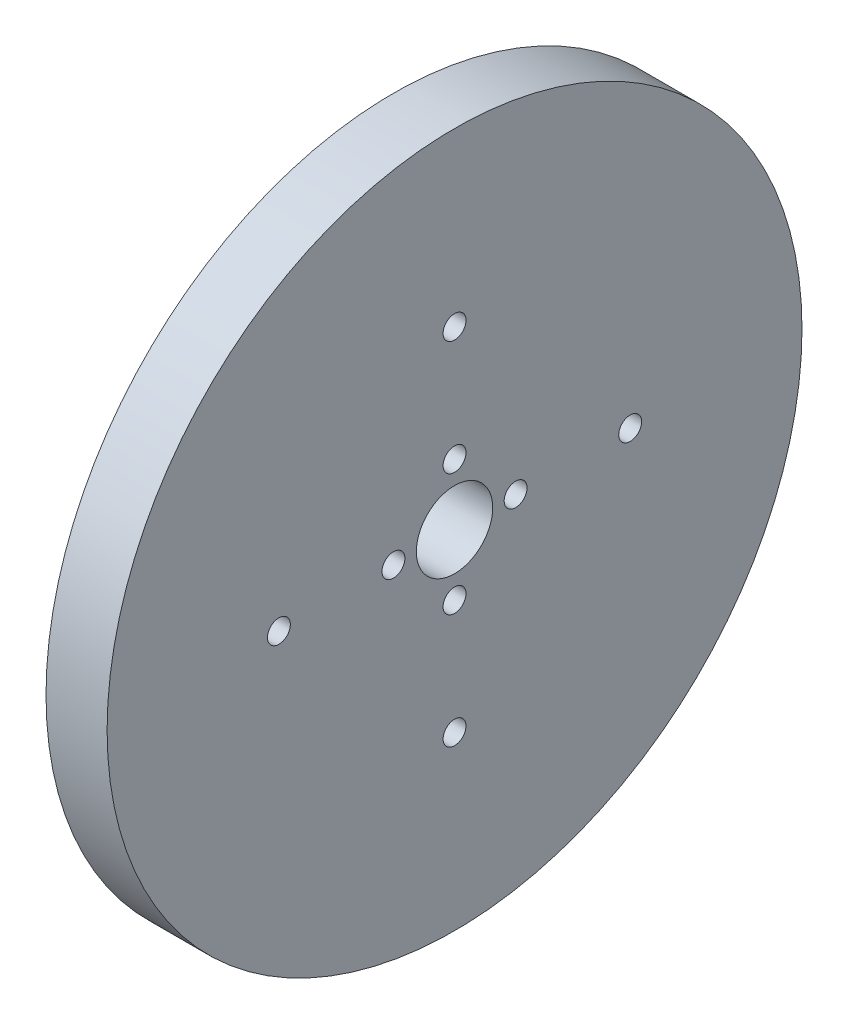
ISO-10303-21;
HEADER;
FILE_DESCRIPTION(('STEP AP214'),'2;1');
FILE_NAME('part.step','',(''),(''),'','','');
FILE_SCHEMA(('AUTOMOTIVE_DESIGN { 1 0 10303 214 1 1 1 1 }'));
ENDSEC;
DATA;
#1=APPLICATION_CONTEXT('core data for automotive mechanical design processes');
#2=APPLICATION_PROTOCOL_DEFINITION('international standard','automotive_design',2000,#1);
#3=PRODUCT_CONTEXT('',#1,'mechanical');
#4=PRODUCT('Part','Part','',(#3));
#5=PRODUCT_RELATED_PRODUCT_CATEGORY('part','',(#4));
#6=PRODUCT_DEFINITION_FORMATION('','',#4);
#7=PRODUCT_DEFINITION_CONTEXT('part definition',#1,'design');
#8=PRODUCT_DEFINITION('design','',#6,#7);
#9=PRODUCT_DEFINITION_SHAPE('','',#8);
#10=(LENGTH_UNIT() NAMED_UNIT(*) SI_UNIT(.MILLI.,.METRE.));
#11=(NAMED_UNIT(*) PLANE_ANGLE_UNIT() SI_UNIT($,.RADIAN.));
#12=(NAMED_UNIT(*) SI_UNIT($,.STERADIAN.) SOLID_ANGLE_UNIT());
#13=UNCERTAINTY_MEASURE_WITH_UNIT(LENGTH_MEASURE(1.E-05),#10,'distance_accuracy_value','');
#14=(GEOMETRIC_REPRESENTATION_CONTEXT(3) GLOBAL_UNCERTAINTY_ASSIGNED_CONTEXT((#13)) GLOBAL_UNIT_ASSIGNED_CONTEXT((#10,
#11,#12)) REPRESENTATION_CONTEXT('',''));
#15=CARTESIAN_POINT('',(0.,0.,0.));
#16=DIRECTION('',(0.,0.,1.));
#17=DIRECTION('',(1.,0.,0.));
#18=AXIS2_PLACEMENT_3D('',#15,#16,#17);
#19=CARTESIAN_POINT('',(8.,0.,0.));
#20=DIRECTION('',(-1.,0.,0.));
#21=DIRECTION('',(0.,0.,-1.));
#22=AXIS2_PLACEMENT_3D('',#19,#20,#21);
#23=CYLINDRICAL_SURFACE('',#22,45.5);
#24=CARTESIAN_POINT('',(8.,0.,0.));
#25=DIRECTION('',(-1.,0.,0.));
#26=DIRECTION('',(0.,0.,1.));
#27=AXIS2_PLACEMENT_3D('',#24,#25,#26);
#28=CIRCLE('',#27,45.5);
#29=CARTESIAN_POINT('',(8.,0.,45.5));
#30=VERTEX_POINT('',#29);
#31=EDGE_CURVE('E10',#30,#30,#28,.T.);
#32=ORIENTED_EDGE('',*,*,#31,.T.);
#33=EDGE_LOOP('',(#32));
#34=FACE_BOUND('',#33,.T.);
#35=CARTESIAN_POINT('',(0.,0.,0.));
#36=DIRECTION('',(-1.,0.,0.));
#37=DIRECTION('',(0.,0.,1.));
#38=AXIS2_PLACEMENT_3D('',#35,#36,#37);
#39=CIRCLE('',#38,45.5);
#40=CARTESIAN_POINT('',(0.,0.,45.5));
#41=VERTEX_POINT('',#40);
#42=EDGE_CURVE('E38',#41,#41,#39,.T.);
#43=ORIENTED_EDGE('',*,*,#42,.F.);
#44=EDGE_LOOP('',(#43));
#45=FACE_BOUND('',#44,.T.);
#46=ADVANCED_FACE('F35',(#34,#45),#23,.T.);
#47=CARTESIAN_POINT('',(8.,0.,0.));
#48=DIRECTION('',(1.,0.,0.));
#49=DIRECTION('',(0.,0.,1.));
#50=AXIS2_PLACEMENT_3D('',#47,#48,#49);
#51=PLANE('',#50);
#52=CARTESIAN_POINT('',(8.,-6.53699316899292E-13,-22.9999999999993));
#53=DIRECTION('',(-1.,0.,0.));
#54=DIRECTION('',(0.,0.,1.));
#55=AXIS2_PLACEMENT_3D('',#52,#53,#54);
#56=CIRCLE('',#55,1.50000000000105);
#57=CARTESIAN_POINT('',(8.,-6.53699316899292E-13,-21.4999999999983));
#58=VERTEX_POINT('',#57);
#59=EDGE_CURVE('E92',#58,#58,#56,.T.);
#60=ORIENTED_EDGE('',*,*,#59,.T.);
#61=EDGE_LOOP('',(#60));
#62=FACE_BOUND('',#61,.T.);
#63=CARTESIAN_POINT('',(8.,0.,-8.));
#64=DIRECTION('',(-1.,0.,0.));
#65=DIRECTION('',(0.,0.,1.));
#66=AXIS2_PLACEMENT_3D('',#63,#64,#65);
#67=CIRCLE('',#66,1.5);
#68=CARTESIAN_POINT('',(8.,0.,-6.5));
#69=VERTEX_POINT('',#68);
#70=EDGE_CURVE('E86',#69,#69,#67,.T.);
#71=ORIENTED_EDGE('',*,*,#70,.T.);
#72=EDGE_LOOP('',(#71));
#73=FACE_BOUND('',#72,.T.);
#74=CARTESIAN_POINT('',(8.,-23.0000000000001,0.));
#75=DIRECTION('',(-1.,0.,0.));
#76=DIRECTION('',(0.,0.,1.));
#77=AXIS2_PLACEMENT_3D('',#74,#75,#76);
#78=CIRCLE('',#77,1.50000000000005);
#79=CARTESIAN_POINT('',(8.,-23.0000000000001,1.49999999999996));
#80=VERTEX_POINT('',#79);
#81=EDGE_CURVE('E80',#80,#80,#78,.T.);
#82=ORIENTED_EDGE('',*,*,#81,.T.);
#83=EDGE_LOOP('',(#82));
#84=FACE_BOUND('',#83,.T.);
#85=CARTESIAN_POINT('',(8.,-8.,0.));
#86=DIRECTION('',(-1.,0.,0.));
#87=DIRECTION('',(0.,0.,1.));
#88=AXIS2_PLACEMENT_3D('',#85,#86,#87);
#89=CIRCLE('',#88,1.5);
#90=CARTESIAN_POINT('',(8.,-8.,1.49999999999994));
#91=VERTEX_POINT('',#90);
#92=EDGE_CURVE('E74',#91,#91,#89,.T.);
#93=ORIENTED_EDGE('',*,*,#92,.T.);
#94=EDGE_LOOP('',(#93));
#95=FACE_BOUND('',#94,.T.);
#96=CARTESIAN_POINT('',(8.,0.,23.));
#97=DIRECTION('',(-1.,0.,0.));
#98=DIRECTION('',(0.,0.,1.));
#99=AXIS2_PLACEMENT_3D('',#96,#97,#98);
#100=CIRCLE('',#99,1.5);
#101=CARTESIAN_POINT('',(8.,0.,24.5));
#102=VERTEX_POINT('',#101);
#103=EDGE_CURVE('E68',#102,#102,#100,.T.);
#104=ORIENTED_EDGE('',*,*,#103,.T.);
#105=EDGE_LOOP('',(#104));
#106=FACE_BOUND('',#105,.T.);
#107=CARTESIAN_POINT('',(8.,0.,8.));
#108=DIRECTION('',(-1.,0.,0.));
#109=DIRECTION('',(0.,0.,1.));
#110=AXIS2_PLACEMENT_3D('',#107,#108,#109);
#111=CIRCLE('',#110,1.5);
#112=CARTESIAN_POINT('',(8.,0.,9.5));
#113=VERTEX_POINT('',#112);
#114=EDGE_CURVE('E62',#113,#113,#111,.T.);
#115=ORIENTED_EDGE('',*,*,#114,.T.);
#116=EDGE_LOOP('',(#115));
#117=FACE_BOUND('',#116,.T.);
#118=CARTESIAN_POINT('',(8.,8.,0.));
#119=DIRECTION('',(-1.,0.,0.));
#120=DIRECTION('',(0.,0.,1.));
#121=AXIS2_PLACEMENT_3D('',#118,#119,#120);
#122=CIRCLE('',#121,1.5);
#123=CARTESIAN_POINT('',(8.,8.,1.5));
#124=VERTEX_POINT('',#123);
#125=EDGE_CURVE('E56',#124,#124,#122,.T.);
#126=ORIENTED_EDGE('',*,*,#125,.T.);
#127=EDGE_LOOP('',(#126));
#128=FACE_BOUND('',#127,.T.);
#129=CARTESIAN_POINT('',(8.,23.,0.));
#130=DIRECTION('',(-1.,0.,0.));
#131=DIRECTION('',(0.,0.,1.));
#132=AXIS2_PLACEMENT_3D('',#129,#130,#131);
#133=CIRCLE('',#132,1.5);
#134=CARTESIAN_POINT('',(8.,23.,1.5));
#135=VERTEX_POINT('',#134);
#136=EDGE_CURVE('E50',#135,#135,#133,.T.);
#137=ORIENTED_EDGE('',*,*,#136,.T.);
#138=EDGE_LOOP('',(#137));
#139=FACE_BOUND('',#138,.T.);
#140=CARTESIAN_POINT('',(8.,0.,0.));
#141=DIRECTION('',(-1.,0.,0.));
#142=DIRECTION('',(0.,0.,1.));
#143=AXIS2_PLACEMENT_3D('',#140,#141,#142);
#144=CIRCLE('',#143,5.);
#145=CARTESIAN_POINT('',(8.,0.,5.));
#146=VERTEX_POINT('',#145);
#147=EDGE_CURVE('E45',#146,#146,#144,.T.);
#148=ORIENTED_EDGE('',*,*,#147,.T.);
#149=EDGE_LOOP('',(#148));
#150=FACE_BOUND('',#149,.T.);
#151=ORIENTED_EDGE('',*,*,#31,.F.);
#152=EDGE_LOOP('',(#151));
#153=FACE_BOUND('',#152,.T.);
#154=ADVANCED_FACE('F101',(#62,#73,#84,#95,#106,#117,#128,#139,#150,#153),#51,.T.);
#155=CARTESIAN_POINT('',(0.,0.,0.));
#156=DIRECTION('',(1.,0.,0.));
#157=DIRECTION('',(0.,0.,1.));
#158=AXIS2_PLACEMENT_3D('',#155,#156,#157);
#159=PLANE('',#158);
#160=CARTESIAN_POINT('',(0.,-6.53699316899292E-13,-22.9999999999993));
#161=DIRECTION('',(-1.,0.,0.));
#162=DIRECTION('',(0.,0.,1.));
#163=AXIS2_PLACEMENT_3D('',#160,#161,#162);
#164=CIRCLE('',#163,1.50000000000105);
#165=CARTESIAN_POINT('',(0.,-6.53699316899292E-13,-21.4999999999983));
#166=VERTEX_POINT('',#165);
#167=EDGE_CURVE('E95',#166,#166,#164,.T.);
#168=ORIENTED_EDGE('',*,*,#167,.F.);
#169=EDGE_LOOP('',(#168));
#170=FACE_BOUND('',#169,.T.);
#171=CARTESIAN_POINT('',(0.,0.,-8.));
#172=DIRECTION('',(-1.,0.,0.));
#173=DIRECTION('',(0.,0.,1.));
#174=AXIS2_PLACEMENT_3D('',#171,#172,#173);
#175=CIRCLE('',#174,1.5);
#176=CARTESIAN_POINT('',(0.,0.,-6.5));
#177=VERTEX_POINT('',#176);
#178=EDGE_CURVE('E89',#177,#177,#175,.T.);
#179=ORIENTED_EDGE('',*,*,#178,.F.);
#180=EDGE_LOOP('',(#179));
#181=FACE_BOUND('',#180,.T.);
#182=CARTESIAN_POINT('',(0.,-23.0000000000001,0.));
#183=DIRECTION('',(-1.,0.,0.));
#184=DIRECTION('',(0.,0.,1.));
#185=AXIS2_PLACEMENT_3D('',#182,#183,#184);
#186=CIRCLE('',#185,1.50000000000005);
#187=CARTESIAN_POINT('',(0.,-23.0000000000001,1.49999999999996));
#188=VERTEX_POINT('',#187);
#189=EDGE_CURVE('E83',#188,#188,#186,.T.);
#190=ORIENTED_EDGE('',*,*,#189,.F.);
#191=EDGE_LOOP('',(#190));
#192=FACE_BOUND('',#191,.T.);
#193=CARTESIAN_POINT('',(0.,-8.,0.));
#194=DIRECTION('',(-1.,0.,0.));
#195=DIRECTION('',(0.,0.,1.));
#196=AXIS2_PLACEMENT_3D('',#193,#194,#195);
#197=CIRCLE('',#196,1.5);
#198=CARTESIAN_POINT('',(0.,-8.,1.49999999999994));
#199=VERTEX_POINT('',#198);
#200=EDGE_CURVE('E77',#199,#199,#197,.T.);
#201=ORIENTED_EDGE('',*,*,#200,.F.);
#202=EDGE_LOOP('',(#201));
#203=FACE_BOUND('',#202,.T.);
#204=CARTESIAN_POINT('',(0.,0.,23.));
#205=DIRECTION('',(-1.,0.,0.));
#206=DIRECTION('',(0.,0.,1.));
#207=AXIS2_PLACEMENT_3D('',#204,#205,#206);
#208=CIRCLE('',#207,1.5);
#209=CARTESIAN_POINT('',(0.,0.,24.5));
#210=VERTEX_POINT('',#209);
#211=EDGE_CURVE('E71',#210,#210,#208,.T.);
#212=ORIENTED_EDGE('',*,*,#211,.F.);
#213=EDGE_LOOP('',(#212));
#214=FACE_BOUND('',#213,.T.);
#215=CARTESIAN_POINT('',(0.,0.,8.));
#216=DIRECTION('',(-1.,0.,0.));
#217=DIRECTION('',(0.,0.,1.));
#218=AXIS2_PLACEMENT_3D('',#215,#216,#217);
#219=CIRCLE('',#218,1.5);
#220=CARTESIAN_POINT('',(0.,0.,9.5));
#221=VERTEX_POINT('',#220);
#222=EDGE_CURVE('E65',#221,#221,#219,.T.);
#223=ORIENTED_EDGE('',*,*,#222,.F.);
#224=EDGE_LOOP('',(#223));
#225=FACE_BOUND('',#224,.T.);
#226=CARTESIAN_POINT('',(0.,8.,0.));
#227=DIRECTION('',(-1.,0.,0.));
#228=DIRECTION('',(0.,0.,1.));
#229=AXIS2_PLACEMENT_3D('',#226,#227,#228);
#230=CIRCLE('',#229,1.5);
#231=CARTESIAN_POINT('',(0.,8.,1.5));
#232=VERTEX_POINT('',#231);
#233=EDGE_CURVE('E59',#232,#232,#230,.T.);
#234=ORIENTED_EDGE('',*,*,#233,.F.);
#235=EDGE_LOOP('',(#234));
#236=FACE_BOUND('',#235,.T.);
#237=CARTESIAN_POINT('',(0.,23.,0.));
#238=DIRECTION('',(-1.,0.,0.));
#239=DIRECTION('',(0.,0.,1.));
#240=AXIS2_PLACEMENT_3D('',#237,#238,#239);
#241=CIRCLE('',#240,1.5);
#242=CARTESIAN_POINT('',(0.,23.,1.5));
#243=VERTEX_POINT('',#242);
#244=EDGE_CURVE('E53',#243,#243,#241,.T.);
#245=ORIENTED_EDGE('',*,*,#244,.F.);
#246=EDGE_LOOP('',(#245));
#247=FACE_BOUND('',#246,.T.);
#248=CARTESIAN_POINT('',(0.,0.,0.));
#249=DIRECTION('',(-1.,0.,0.));
#250=DIRECTION('',(0.,0.,1.));
#251=AXIS2_PLACEMENT_3D('',#248,#249,#250);
#252=CIRCLE('',#251,5.);
#253=CARTESIAN_POINT('',(0.,0.,5.));
#254=VERTEX_POINT('',#253);
#255=EDGE_CURVE('E47',#254,#254,#252,.T.);
#256=ORIENTED_EDGE('',*,*,#255,.F.);
#257=EDGE_LOOP('',(#256));
#258=FACE_BOUND('',#257,.T.);
#259=ORIENTED_EDGE('',*,*,#42,.T.);
#260=EDGE_LOOP('',(#259));
#261=FACE_BOUND('',#260,.T.);
#262=ADVANCED_FACE('F111',(#170,#181,#192,#203,#214,#225,#236,#247,#258,#261),#159,.F.);
#263=CARTESIAN_POINT('',(8.,0.,0.));
#264=DIRECTION('',(-1.,0.,0.));
#265=DIRECTION('',(0.,0.,-1.));
#266=AXIS2_PLACEMENT_3D('',#263,#264,#265);
#267=CYLINDRICAL_SURFACE('',#266,5.);
#268=ORIENTED_EDGE('',*,*,#147,.F.);
#269=EDGE_LOOP('',(#268));
#270=FACE_BOUND('',#269,.T.);
#271=ORIENTED_EDGE('',*,*,#255,.T.);
#272=EDGE_LOOP('',(#271));
#273=FACE_BOUND('',#272,.T.);
#274=ADVANCED_FACE('F114',(#270,#273),#267,.F.);
#275=CARTESIAN_POINT('',(8.,23.,0.));
#276=DIRECTION('',(-1.,0.,0.));
#277=DIRECTION('',(0.,0.,-1.));
#278=AXIS2_PLACEMENT_3D('',#275,#276,#277);
#279=CYLINDRICAL_SURFACE('',#278,1.5);
#280=ORIENTED_EDGE('',*,*,#136,.F.);
#281=EDGE_LOOP('',(#280));
#282=FACE_BOUND('',#281,.T.);
#283=ORIENTED_EDGE('',*,*,#244,.T.);
#284=EDGE_LOOP('',(#283));
#285=FACE_BOUND('',#284,.T.);
#286=ADVANCED_FACE('F143',(#282,#285),#279,.F.);
#287=CARTESIAN_POINT('',(8.,8.,0.));
#288=DIRECTION('',(-1.,0.,0.));
#289=DIRECTION('',(0.,0.,-1.));
#290=AXIS2_PLACEMENT_3D('',#287,#288,#289);
#291=CYLINDRICAL_SURFACE('',#290,1.5);
#292=ORIENTED_EDGE('',*,*,#125,.F.);
#293=EDGE_LOOP('',(#292));
#294=FACE_BOUND('',#293,.T.);
#295=ORIENTED_EDGE('',*,*,#233,.T.);
#296=EDGE_LOOP('',(#295));
#297=FACE_BOUND('',#296,.T.);
#298=ADVANCED_FACE('F147',(#294,#297),#291,.F.);
#299=CARTESIAN_POINT('',(8.,0.,8.));
#300=DIRECTION('',(-1.,0.,0.));
#301=DIRECTION('',(0.,0.,-1.));
#302=AXIS2_PLACEMENT_3D('',#299,#300,#301);
#303=CYLINDRICAL_SURFACE('',#302,1.5);
#304=ORIENTED_EDGE('',*,*,#114,.F.);
#305=EDGE_LOOP('',(#304));
#306=FACE_BOUND('',#305,.T.);
#307=ORIENTED_EDGE('',*,*,#222,.T.);
#308=EDGE_LOOP('',(#307));
#309=FACE_BOUND('',#308,.T.);
#310=ADVANCED_FACE('F151',(#306,#309),#303,.F.);
#311=CARTESIAN_POINT('',(8.,0.,23.));
#312=DIRECTION('',(-1.,0.,0.));
#313=DIRECTION('',(0.,0.,-1.));
#314=AXIS2_PLACEMENT_3D('',#311,#312,#313);
#315=CYLINDRICAL_SURFACE('',#314,1.5);
#316=ORIENTED_EDGE('',*,*,#103,.F.);
#317=EDGE_LOOP('',(#316));
#318=FACE_BOUND('',#317,.T.);
#319=ORIENTED_EDGE('',*,*,#211,.T.);
#320=EDGE_LOOP('',(#319));
#321=FACE_BOUND('',#320,.T.);
#322=ADVANCED_FACE('F155',(#318,#321),#315,.F.);
#323=CARTESIAN_POINT('',(8.,-8.,0.));
#324=DIRECTION('',(-1.,0.,0.));
#325=DIRECTION('',(0.,0.,-1.));
#326=AXIS2_PLACEMENT_3D('',#323,#324,#325);
#327=CYLINDRICAL_SURFACE('',#326,1.5);
#328=ORIENTED_EDGE('',*,*,#92,.F.);
#329=EDGE_LOOP('',(#328));
#330=FACE_BOUND('',#329,.T.);
#331=ORIENTED_EDGE('',*,*,#200,.T.);
#332=EDGE_LOOP('',(#331));
#333=FACE_BOUND('',#332,.T.);
#334=ADVANCED_FACE('F159',(#330,#333),#327,.F.);
#335=CARTESIAN_POINT('',(8.,-23.0000000000001,0.));
#336=DIRECTION('',(-1.,0.,0.));
#337=DIRECTION('',(0.,0.,-1.));
#338=AXIS2_PLACEMENT_3D('',#335,#336,#337);
#339=CYLINDRICAL_SURFACE('',#338,1.50000000000005);
#340=ORIENTED_EDGE('',*,*,#81,.F.);
#341=EDGE_LOOP('',(#340));
#342=FACE_BOUND('',#341,.T.);
#343=ORIENTED_EDGE('',*,*,#189,.T.);
#344=EDGE_LOOP('',(#343));
#345=FACE_BOUND('',#344,.T.);
#346=ADVANCED_FACE('F163',(#342,#345),#339,.F.);
#347=CARTESIAN_POINT('',(8.,0.,-8.));
#348=DIRECTION('',(-1.,0.,0.));
#349=DIRECTION('',(0.,0.,-1.));
#350=AXIS2_PLACEMENT_3D('',#347,#348,#349);
#351=CYLINDRICAL_SURFACE('',#350,1.5);
#352=ORIENTED_EDGE('',*,*,#70,.F.);
#353=EDGE_LOOP('',(#352));
#354=FACE_BOUND('',#353,.T.);
#355=ORIENTED_EDGE('',*,*,#178,.T.);
#356=EDGE_LOOP('',(#355));
#357=FACE_BOUND('',#356,.T.);
#358=ADVANCED_FACE('F107',(#354,#357),#351,.F.);
#359=CARTESIAN_POINT('',(8.,-6.53699316899292E-13,-22.9999999999993));
#360=DIRECTION('',(-1.,0.,0.));
#361=DIRECTION('',(0.,0.,-1.));
#362=AXIS2_PLACEMENT_3D('',#359,#360,#361);
#363=CYLINDRICAL_SURFACE('',#362,1.50000000000105);
#364=ORIENTED_EDGE('',*,*,#59,.F.);
#365=EDGE_LOOP('',(#364));
#366=FACE_BOUND('',#365,.T.);
#367=ORIENTED_EDGE('',*,*,#167,.T.);
#368=EDGE_LOOP('',(#367));
#369=FACE_BOUND('',#368,.T.);
#370=ADVANCED_FACE('F104',(#366,#369),#363,.F.);
#371=CLOSED_SHELL('',(#46,#154,#262,#274,#286,#298,#310,#322,#334,#346,#358,#370));
#372=MANIFOLD_SOLID_BREP('B2',#371);
#373=ADVANCED_BREP_SHAPE_REPRESENTATION('',(#18,#372),#14);
#374=SHAPE_DEFINITION_REPRESENTATION(#9,#373);
ENDSEC;
END-ISO-10303-21;
